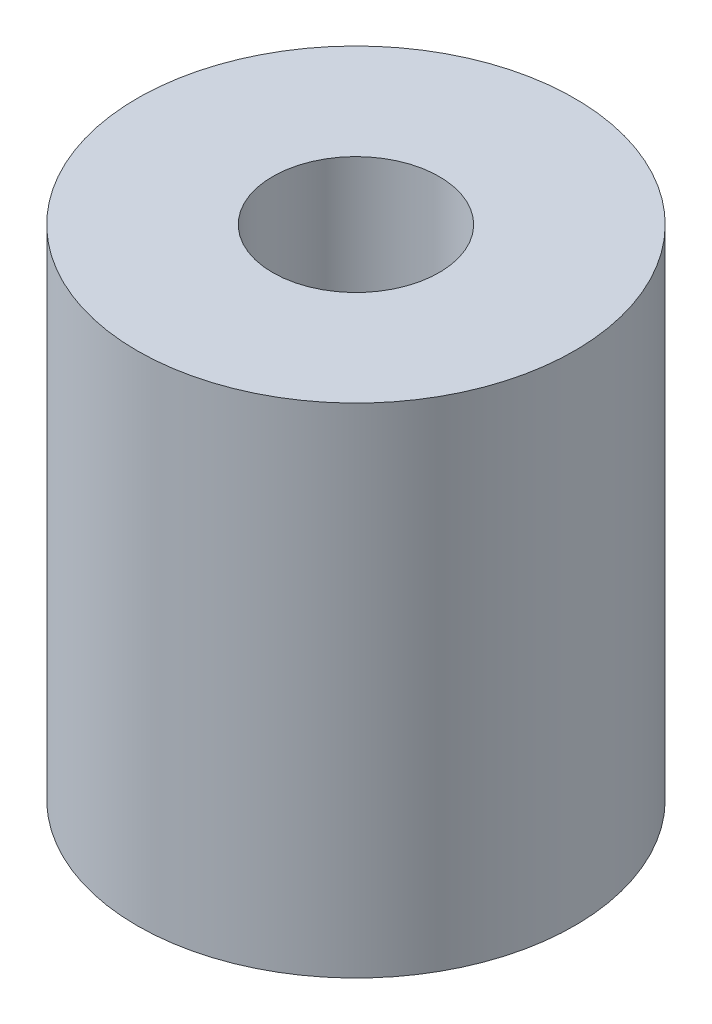
ISO-10303-21;
HEADER;
FILE_DESCRIPTION(('STEP AP214'),'2;1');
FILE_NAME('part.step','',(''),(''),'','','');
FILE_SCHEMA(('AUTOMOTIVE_DESIGN { 1 0 10303 214 1 1 1 1 }'));
ENDSEC;
DATA;
#1=APPLICATION_CONTEXT('core data for automotive mechanical design processes');
#2=APPLICATION_PROTOCOL_DEFINITION('international standard','automotive_design',2000,#1);
#3=PRODUCT_CONTEXT('',#1,'mechanical');
#4=PRODUCT('Part','Part','',(#3));
#5=PRODUCT_RELATED_PRODUCT_CATEGORY('part','',(#4));
#6=PRODUCT_DEFINITION_FORMATION('','',#4);
#7=PRODUCT_DEFINITION_CONTEXT('part definition',#1,'design');
#8=PRODUCT_DEFINITION('design','',#6,#7);
#9=PRODUCT_DEFINITION_SHAPE('','',#8);
#10=(LENGTH_UNIT() NAMED_UNIT(*) SI_UNIT(.MILLI.,.METRE.));
#11=(NAMED_UNIT(*) PLANE_ANGLE_UNIT() SI_UNIT($,.RADIAN.));
#12=(NAMED_UNIT(*) SI_UNIT($,.STERADIAN.) SOLID_ANGLE_UNIT());
#13=UNCERTAINTY_MEASURE_WITH_UNIT(LENGTH_MEASURE(1.E-05),#10,'distance_accuracy_value','');
#14=(GEOMETRIC_REPRESENTATION_CONTEXT(3) GLOBAL_UNCERTAINTY_ASSIGNED_CONTEXT((#13)) GLOBAL_UNIT_ASSIGNED_CONTEXT((#10,
#11,#12)) REPRESENTATION_CONTEXT('',''));
#15=CARTESIAN_POINT('',(0.,0.,0.));
#16=DIRECTION('',(0.,0.,1.));
#17=DIRECTION('',(1.,0.,0.));
#18=AXIS2_PLACEMENT_3D('',#15,#16,#17);
#19=CARTESIAN_POINT('',(0.,29.6,0.));
#20=DIRECTION('',(0.,1.,0.));
#21=DIRECTION('',(0.,0.,1.));
#22=AXIS2_PLACEMENT_3D('',#19,#20,#21);
#23=PLANE('',#22);
#24=CARTESIAN_POINT('',(0.,29.6,0.));
#25=DIRECTION('',(0.,1.,0.));
#26=DIRECTION('',(0.,0.,1.));
#27=AXIS2_PLACEMENT_3D('',#24,#25,#26);
#28=CIRCLE('',#27,13.);
#29=CARTESIAN_POINT('',(0.,29.6,13.));
#30=VERTEX_POINT('',#29);
#31=EDGE_CURVE('E45',#30,#30,#28,.T.);
#32=ORIENTED_EDGE('',*,*,#31,.T.);
#33=EDGE_LOOP('',(#32));
#34=FACE_BOUND('',#33,.T.);
#35=CARTESIAN_POINT('',(0.,29.6,0.));
#36=DIRECTION('',(0.,1.,0.));
#37=DIRECTION('',(0.,0.,1.));
#38=AXIS2_PLACEMENT_3D('',#35,#36,#37);
#39=CIRCLE('',#38,4.95);
#40=CARTESIAN_POINT('',(0.,29.6,4.95));
#41=VERTEX_POINT('',#40);
#42=EDGE_CURVE('E53',#41,#41,#39,.T.);
#43=ORIENTED_EDGE('',*,*,#42,.F.);
#44=EDGE_LOOP('',(#43));
#45=FACE_BOUND('',#44,.T.);
#46=ADVANCED_FACE('F34',(#34,#45),#23,.T.);
#47=CARTESIAN_POINT('',(0.,0.,0.));
#48=DIRECTION('',(0.,1.,0.));
#49=DIRECTION('',(0.,0.,1.));
#50=AXIS2_PLACEMENT_3D('',#47,#48,#49);
#51=PLANE('',#50);
#52=CARTESIAN_POINT('',(0.,0.,0.));
#53=DIRECTION('',(0.,1.,0.));
#54=DIRECTION('',(0.,0.,1.));
#55=AXIS2_PLACEMENT_3D('',#52,#53,#54);
#56=CIRCLE('',#55,13.);
#57=CARTESIAN_POINT('',(0.,0.,13.));
#58=VERTEX_POINT('',#57);
#59=EDGE_CURVE('E49',#58,#58,#56,.T.);
#60=ORIENTED_EDGE('',*,*,#59,.F.);
#61=EDGE_LOOP('',(#60));
#62=FACE_BOUND('',#61,.T.);
#63=CARTESIAN_POINT('',(0.,0.,0.));
#64=DIRECTION('',(0.,-1.,0.));
#65=DIRECTION('',(0.,0.,-1.));
#66=AXIS2_PLACEMENT_3D('',#63,#64,#65);
#67=CIRCLE('',#66,3.9);
#68=CARTESIAN_POINT('',(0.,0.,-3.9));
#69=VERTEX_POINT('',#68);
#70=EDGE_CURVE('E57',#69,#69,#67,.T.);
#71=ORIENTED_EDGE('',*,*,#70,.F.);
#72=EDGE_LOOP('',(#71));
#73=FACE_BOUND('',#72,.T.);
#74=ADVANCED_FACE('F63',(#62,#73),#51,.F.);
#75=CARTESIAN_POINT('',(0.,29.6,0.));
#76=DIRECTION('',(0.,-1.,0.));
#77=DIRECTION('',(0.,0.,-1.));
#78=AXIS2_PLACEMENT_3D('',#75,#76,#77);
#79=CYLINDRICAL_SURFACE('',#78,13.);
#80=ORIENTED_EDGE('',*,*,#31,.F.);
#81=EDGE_LOOP('',(#80));
#82=FACE_BOUND('',#81,.T.);
#83=ORIENTED_EDGE('',*,*,#59,.T.);
#84=EDGE_LOOP('',(#83));
#85=FACE_BOUND('',#84,.T.);
#86=ADVANCED_FACE('F36',(#82,#85),#79,.T.);
#87=CARTESIAN_POINT('',(0.,29.6,0.));
#88=DIRECTION('',(0.,-1.,0.));
#89=DIRECTION('',(0.,0.,-1.));
#90=AXIS2_PLACEMENT_3D('',#87,#88,#89);
#91=CYLINDRICAL_SURFACE('',#90,4.95);
#92=CARTESIAN_POINT('',(0.,18.650573,0.));
#93=DIRECTION('',(0.,1.,0.));
#94=DIRECTION('',(0.,0.,1.));
#95=AXIS2_PLACEMENT_3D('',#92,#93,#94);
#96=CIRCLE('',#95,4.95);
#97=CARTESIAN_POINT('',(0.,18.650573,4.95));
#98=VERTEX_POINT('',#97);
#99=EDGE_CURVE('E41',#98,#98,#96,.T.);
#100=ORIENTED_EDGE('',*,*,#99,.F.);
#101=EDGE_LOOP('',(#100));
#102=FACE_BOUND('',#101,.T.);
#103=ORIENTED_EDGE('',*,*,#42,.T.);
#104=EDGE_LOOP('',(#103));
#105=FACE_BOUND('',#104,.T.);
#106=ADVANCED_FACE('F70',(#102,#105),#91,.F.);
#107=CARTESIAN_POINT('',(0.,18.650573,0.));
#108=DIRECTION('',(0.,1.,0.));
#109=DIRECTION('',(0.,0.,1.));
#110=AXIS2_PLACEMENT_3D('',#107,#108,#109);
#111=PLANE('',#110);
#112=ORIENTED_EDGE('',*,*,#99,.T.);
#113=EDGE_LOOP('',(#112));
#114=FACE_BOUND('',#113,.T.);
#115=ADVANCED_FACE('F78',(#114),#111,.T.);
#116=CARTESIAN_POINT('',(0.,11.85,0.));
#117=DIRECTION('',(0.,-1.,0.));
#118=DIRECTION('',(0.,0.,-1.));
#119=AXIS2_PLACEMENT_3D('',#116,#117,#118);
#120=CYLINDRICAL_SURFACE('',#119,3.9);
#121=ORIENTED_EDGE('',*,*,#70,.T.);
#122=EDGE_LOOP('',(#121));
#123=FACE_BOUND('',#122,.T.);
#124=CARTESIAN_POINT('',(0.,10.,0.));
#125=DIRECTION('',(0.,1.,0.));
#126=DIRECTION('',(0.,0.,1.));
#127=AXIS2_PLACEMENT_3D('',#124,#125,#126);
#128=CIRCLE('',#127,3.9);
#129=CARTESIAN_POINT('',(0.,10.,3.9));
#130=VERTEX_POINT('',#129);
#131=EDGE_CURVE('E11',#130,#130,#128,.T.);
#132=ORIENTED_EDGE('',*,*,#131,.T.);
#133=EDGE_LOOP('',(#132));
#134=FACE_BOUND('',#133,.T.);
#135=ADVANCED_FACE('F61',(#123,#134),#120,.F.);
#136=CARTESIAN_POINT('',(0.,10.,0.));
#137=DIRECTION('',(0.,1.,0.));
#138=DIRECTION('',(0.,0.,1.));
#139=AXIS2_PLACEMENT_3D('',#136,#137,#138);
#140=PLANE('',#139);
#141=ORIENTED_EDGE('',*,*,#131,.F.);
#142=EDGE_LOOP('',(#141));
#143=FACE_BOUND('',#142,.T.);
#144=ADVANCED_FACE('F82',(#143),#140,.F.);
#145=CLOSED_SHELL('',(#46,#74,#86,#106,#115,#135,#144));
#146=MANIFOLD_SOLID_BREP('B2',#145);
#147=ADVANCED_BREP_SHAPE_REPRESENTATION('',(#18,#146),#14);
#148=SHAPE_DEFINITION_REPRESENTATION(#9,#147);
ENDSEC;
END-ISO-10303-21;
